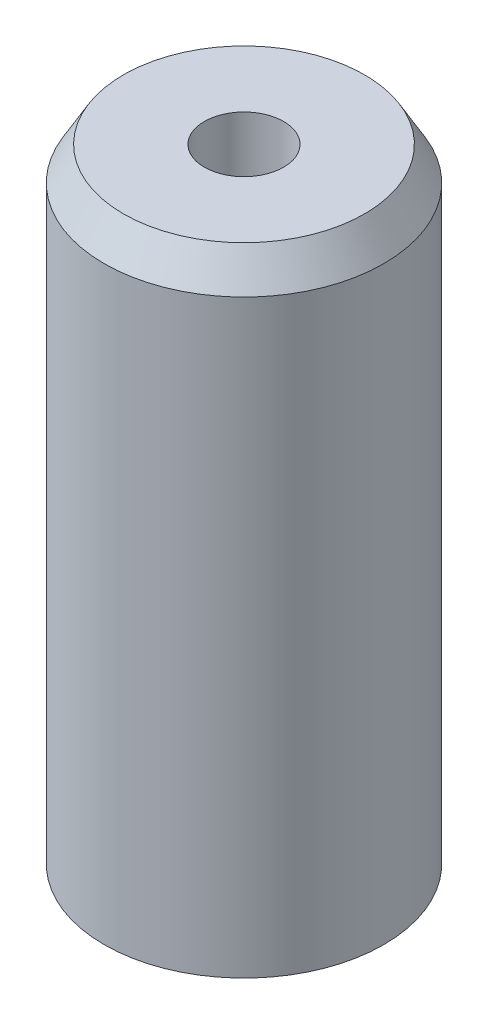
ISO-10303-21;
HEADER;
FILE_DESCRIPTION(('STEP AP214'),'2;1');
FILE_NAME('part.step','',(''),(''),'','','');
FILE_SCHEMA(('AUTOMOTIVE_DESIGN { 1 0 10303 214 1 1 1 1 }'));
ENDSEC;
DATA;
#1=APPLICATION_CONTEXT('core data for automotive mechanical design processes');
#2=APPLICATION_PROTOCOL_DEFINITION('international standard','automotive_design',2000,#1);
#3=PRODUCT_CONTEXT('',#1,'mechanical');
#4=PRODUCT('Part','Part','',(#3));
#5=PRODUCT_RELATED_PRODUCT_CATEGORY('part','',(#4));
#6=PRODUCT_DEFINITION_FORMATION('','',#4);
#7=PRODUCT_DEFINITION_CONTEXT('part definition',#1,'design');
#8=PRODUCT_DEFINITION('design','',#6,#7);
#9=PRODUCT_DEFINITION_SHAPE('','',#8);
#10=(LENGTH_UNIT() NAMED_UNIT(*) SI_UNIT(.MILLI.,.METRE.));
#11=(NAMED_UNIT(*) PLANE_ANGLE_UNIT() SI_UNIT($,.RADIAN.));
#12=(NAMED_UNIT(*) SI_UNIT($,.STERADIAN.) SOLID_ANGLE_UNIT());
#13=UNCERTAINTY_MEASURE_WITH_UNIT(LENGTH_MEASURE(1.E-05),#10,'distance_accuracy_value','');
#14=(GEOMETRIC_REPRESENTATION_CONTEXT(3) GLOBAL_UNCERTAINTY_ASSIGNED_CONTEXT((#13)) GLOBAL_UNIT_ASSIGNED_CONTEXT((#10,
#11,#12)) REPRESENTATION_CONTEXT('',''));
#15=CARTESIAN_POINT('',(0.,0.,0.));
#16=DIRECTION('',(0.,0.,1.));
#17=DIRECTION('',(1.,0.,0.));
#18=AXIS2_PLACEMENT_3D('',#15,#16,#17);
#19=CARTESIAN_POINT('',(0.,68.9309107739292,0.));
#20=DIRECTION('',(0.,-1.,0.));
#21=DIRECTION('',(0.,0.,-1.));
#22=AXIS2_PLACEMENT_3D('',#19,#20,#21);
#23=CYLINDRICAL_SURFACE('',#22,15.);
#24=CARTESIAN_POINT('',(0.,65.3447576997621,0.));
#25=DIRECTION('',(0.,1.,0.));
#26=DIRECTION('',(0.,0.,1.));
#27=AXIS2_PLACEMENT_3D('',#24,#25,#26);
#28=CIRCLE('',#27,15.);
#29=CARTESIAN_POINT('',(0.,65.3447576997621,15.));
#30=VERTEX_POINT('',#29);
#31=EDGE_CURVE('E50',#30,#30,#28,.F.);
#32=ORIENTED_EDGE('',*,*,#31,.T.);
#33=EDGE_LOOP('',(#32));
#34=FACE_BOUND('',#33,.T.);
#35=CARTESIAN_POINT('',(0.,2.07046644272557,0.));
#36=DIRECTION('',(0.,1.,0.));
#37=DIRECTION('',(0.,0.,1.));
#38=AXIS2_PLACEMENT_3D('',#35,#36,#37);
#39=CIRCLE('',#38,15.);
#40=CARTESIAN_POINT('',(0.,2.07046644272557,15.));
#41=VERTEX_POINT('',#40);
#42=EDGE_CURVE('E51',#41,#41,#39,.T.);
#43=ORIENTED_EDGE('',*,*,#42,.T.);
#44=EDGE_LOOP('',(#43));
#45=FACE_BOUND('',#44,.T.);
#46=ADVANCED_FACE('F39',(#34,#45),#23,.T.);
#47=CARTESIAN_POINT('',(0.,68.9309107739292,0.));
#48=DIRECTION('',(0.,1.,0.));
#49=DIRECTION('',(0.,0.,1.));
#50=AXIS2_PLACEMENT_3D('',#47,#48,#49);
#51=PLANE('',#50);
#52=CARTESIAN_POINT('',(0.,68.9309107739292,0.));
#53=DIRECTION('',(0.,1.,0.));
#54=DIRECTION('',(0.,0.,1.));
#55=AXIS2_PLACEMENT_3D('',#52,#53,#54);
#56=CIRCLE('',#55,12.9295335572744);
#57=CARTESIAN_POINT('',(0.,68.9309107739292,12.9295335572744));
#58=VERTEX_POINT('',#57);
#59=EDGE_CURVE('E54',#58,#58,#56,.T.);
#60=ORIENTED_EDGE('',*,*,#59,.T.);
#61=EDGE_LOOP('',(#60));
#62=FACE_BOUND('',#61,.T.);
#63=CARTESIAN_POINT('',(0.,68.9309107739292,0.));
#64=DIRECTION('',(0.,1.,0.));
#65=DIRECTION('',(0.,0.,1.));
#66=AXIS2_PLACEMENT_3D('',#63,#64,#65);
#67=CIRCLE('',#66,4.25370512590438);
#68=CARTESIAN_POINT('',(0.,68.9309107739292,4.25370512590438));
#69=VERTEX_POINT('',#68);
#70=EDGE_CURVE('E58',#69,#69,#67,.T.);
#71=ORIENTED_EDGE('',*,*,#70,.F.);
#72=EDGE_LOOP('',(#71));
#73=FACE_BOUND('',#72,.T.);
#74=ADVANCED_FACE('F69',(#62,#73),#51,.T.);
#75=CARTESIAN_POINT('',(0.,0.,0.));
#76=DIRECTION('',(0.,1.,0.));
#77=DIRECTION('',(0.,0.,1.));
#78=AXIS2_PLACEMENT_3D('',#75,#76,#77);
#79=PLANE('',#78);
#80=CARTESIAN_POINT('',(0.,0.,0.));
#81=DIRECTION('',(0.,1.,0.));
#82=DIRECTION('',(0.,0.,1.));
#83=AXIS2_PLACEMENT_3D('',#80,#81,#82);
#84=CIRCLE('',#83,11.4138469258329);
#85=CARTESIAN_POINT('',(0.,0.,11.4138469258329));
#86=VERTEX_POINT('',#85);
#87=EDGE_CURVE('E10',#86,#86,#84,.F.);
#88=ORIENTED_EDGE('',*,*,#87,.T.);
#89=EDGE_LOOP('',(#88));
#90=FACE_BOUND('',#89,.T.);
#91=CARTESIAN_POINT('',(0.,0.,0.));
#92=DIRECTION('',(0.,1.,0.));
#93=DIRECTION('',(0.,0.,1.));
#94=AXIS2_PLACEMENT_3D('',#91,#92,#93);
#95=CIRCLE('',#94,4.25370512590438);
#96=CARTESIAN_POINT('',(0.,0.,4.25370512590438));
#97=VERTEX_POINT('',#96);
#98=EDGE_CURVE('E63',#97,#97,#95,.T.);
#99=ORIENTED_EDGE('',*,*,#98,.T.);
#100=EDGE_LOOP('',(#99));
#101=FACE_BOUND('',#100,.T.);
#102=ADVANCED_FACE('F75',(#90,#101),#79,.F.);
#103=CARTESIAN_POINT('',(0.,68.9309107739292,0.));
#104=DIRECTION('',(0.,-1.,0.));
#105=DIRECTION('',(0.,0.,-1.));
#106=AXIS2_PLACEMENT_3D('',#103,#104,#105);
#107=CYLINDRICAL_SURFACE('',#106,4.25370512590438);
#108=ORIENTED_EDGE('',*,*,#70,.T.);
#109=EDGE_LOOP('',(#108));
#110=FACE_BOUND('',#109,.T.);
#111=ORIENTED_EDGE('',*,*,#98,.F.);
#112=EDGE_LOOP('',(#111));
#113=FACE_BOUND('',#112,.T.);
#114=ADVANCED_FACE('F70',(#110,#113),#107,.F.);
#115=CARTESIAN_POINT('',(0.,68.9309107739292,0.));
#116=DIRECTION('',(0.,-1.,0.));
#117=DIRECTION('',(0.,0.,-1.));
#118=AXIS2_PLACEMENT_3D('',#115,#116,#117);
#119=CONICAL_SURFACE('',#118,12.9295335572744,0.523598775598294);
#120=ORIENTED_EDGE('',*,*,#31,.F.);
#121=EDGE_LOOP('',(#120));
#122=FACE_BOUND('',#121,.T.);
#123=ORIENTED_EDGE('',*,*,#59,.F.);
#124=EDGE_LOOP('',(#123));
#125=FACE_BOUND('',#124,.T.);
#126=ADVANCED_FACE('F81',(#122,#125),#119,.T.);
#127=CARTESIAN_POINT('',(0.,2.07046644272557,0.));
#128=DIRECTION('',(0.,1.,0.));
#129=DIRECTION('',(0.,0.,1.));
#130=AXIS2_PLACEMENT_3D('',#127,#128,#129);
#131=CONICAL_SURFACE('',#130,15.,1.0471975511966);
#132=ORIENTED_EDGE('',*,*,#87,.F.);
#133=EDGE_LOOP('',(#132));
#134=FACE_BOUND('',#133,.T.);
#135=ORIENTED_EDGE('',*,*,#42,.F.);
#136=EDGE_LOOP('',(#135));
#137=FACE_BOUND('',#136,.T.);
#138=ADVANCED_FACE('F45',(#134,#137),#131,.T.);
#139=CLOSED_SHELL('',(#46,#74,#102,#114,#126,#138));
#140=MANIFOLD_SOLID_BREP('B2',#139);
#141=ADVANCED_BREP_SHAPE_REPRESENTATION('',(#18,#140),#14);
#142=SHAPE_DEFINITION_REPRESENTATION(#9,#141);
ENDSEC;
END-ISO-10303-21;
